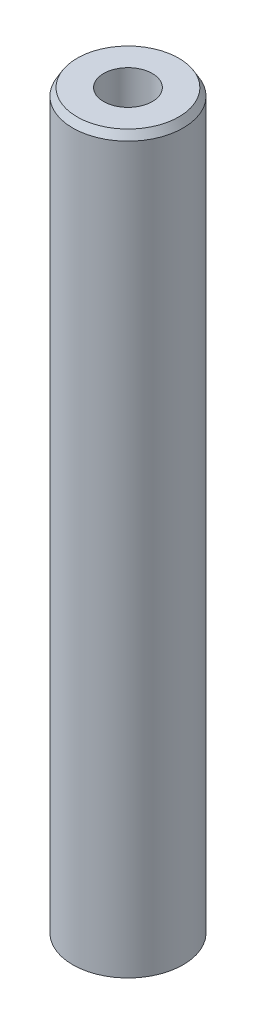
ISO-10303-21;
HEADER;
FILE_DESCRIPTION(('STEP AP214'),'2;1');
FILE_NAME('part.step','',(''),(''),'','','');
FILE_SCHEMA(('AUTOMOTIVE_DESIGN { 1 0 10303 214 1 1 1 1 }'));
ENDSEC;
DATA;
#1=APPLICATION_CONTEXT('core data for automotive mechanical design processes');
#2=APPLICATION_PROTOCOL_DEFINITION('international standard','automotive_design',2000,#1);
#3=PRODUCT_CONTEXT('',#1,'mechanical');
#4=PRODUCT('Part','Part','',(#3));
#5=PRODUCT_RELATED_PRODUCT_CATEGORY('part','',(#4));
#6=PRODUCT_DEFINITION_FORMATION('','',#4);
#7=PRODUCT_DEFINITION_CONTEXT('part definition',#1,'design');
#8=PRODUCT_DEFINITION('design','',#6,#7);
#9=PRODUCT_DEFINITION_SHAPE('','',#8);
#10=(LENGTH_UNIT() NAMED_UNIT(*) SI_UNIT(.MILLI.,.METRE.));
#11=(NAMED_UNIT(*) PLANE_ANGLE_UNIT() SI_UNIT($,.RADIAN.));
#12=(NAMED_UNIT(*) SI_UNIT($,.STERADIAN.) SOLID_ANGLE_UNIT());
#13=UNCERTAINTY_MEASURE_WITH_UNIT(LENGTH_MEASURE(1.E-05),#10,'distance_accuracy_value','');
#14=(GEOMETRIC_REPRESENTATION_CONTEXT(3) GLOBAL_UNCERTAINTY_ASSIGNED_CONTEXT((#13)) GLOBAL_UNIT_ASSIGNED_CONTEXT((#10,
#11,#12)) REPRESENTATION_CONTEXT('',''));
#15=CARTESIAN_POINT('',(0.,0.,0.));
#16=DIRECTION('',(0.,0.,1.));
#17=DIRECTION('',(1.,0.,0.));
#18=AXIS2_PLACEMENT_3D('',#15,#16,#17);
#19=CARTESIAN_POINT('',(0.,133.387566286596,0.));
#20=DIRECTION('',(0.,-1.,0.));
#21=DIRECTION('',(0.,0.,-1.));
#22=AXIS2_PLACEMENT_3D('',#19,#20,#21);
#23=CYLINDRICAL_SURFACE('',#22,10.);
#24=CARTESIAN_POINT('',(0.,132.037444312426,0.));
#25=DIRECTION('',(0.,1.,0.));
#26=DIRECTION('',(0.,0.,1.));
#27=AXIS2_PLACEMENT_3D('',#24,#25,#26);
#28=CIRCLE('',#27,10.);
#29=CARTESIAN_POINT('',(0.,132.037444312426,10.));
#30=VERTEX_POINT('',#29);
#31=EDGE_CURVE('E50',#30,#30,#28,.F.);
#32=ORIENTED_EDGE('',*,*,#31,.T.);
#33=EDGE_LOOP('',(#32));
#34=FACE_BOUND('',#33,.T.);
#35=CARTESIAN_POINT('',(0.,0.786198644598113,0.));
#36=DIRECTION('',(0.,1.,0.));
#37=DIRECTION('',(0.,0.,1.));
#38=AXIS2_PLACEMENT_3D('',#35,#36,#37);
#39=CIRCLE('',#38,10.);
#40=CARTESIAN_POINT('',(0.,0.786198644598113,10.));
#41=VERTEX_POINT('',#40);
#42=EDGE_CURVE('E51',#41,#41,#39,.T.);
#43=ORIENTED_EDGE('',*,*,#42,.T.);
#44=EDGE_LOOP('',(#43));
#45=FACE_BOUND('',#44,.T.);
#46=ADVANCED_FACE('F39',(#34,#45),#23,.T.);
#47=CARTESIAN_POINT('',(0.,133.387566286596,0.));
#48=DIRECTION('',(0.,1.,0.));
#49=DIRECTION('',(0.,0.,1.));
#50=AXIS2_PLACEMENT_3D('',#47,#48,#49);
#51=PLANE('',#50);
#52=CARTESIAN_POINT('',(0.,133.387566286596,0.));
#53=DIRECTION('',(0.,1.,0.));
#54=DIRECTION('',(0.,0.,1.));
#55=AXIS2_PLACEMENT_3D('',#52,#53,#54);
#56=CIRCLE('',#55,9.21380135540185);
#57=CARTESIAN_POINT('',(0.,133.387566286596,9.21380135540185));
#58=VERTEX_POINT('',#57);
#59=EDGE_CURVE('E54',#58,#58,#56,.T.);
#60=ORIENTED_EDGE('',*,*,#59,.T.);
#61=EDGE_LOOP('',(#60));
#62=FACE_BOUND('',#61,.T.);
#63=CARTESIAN_POINT('',(0.,133.387566286596,0.));
#64=DIRECTION('',(0.,1.,0.));
#65=DIRECTION('',(0.,0.,1.));
#66=AXIS2_PLACEMENT_3D('',#63,#64,#65);
#67=CIRCLE('',#66,4.41227959361219);
#68=CARTESIAN_POINT('',(0.,133.387566286596,4.41227959361219));
#69=VERTEX_POINT('',#68);
#70=EDGE_CURVE('E58',#69,#69,#67,.T.);
#71=ORIENTED_EDGE('',*,*,#70,.F.);
#72=EDGE_LOOP('',(#71));
#73=FACE_BOUND('',#72,.T.);
#74=ADVANCED_FACE('F69',(#62,#73),#51,.T.);
#75=CARTESIAN_POINT('',(0.,0.,0.));
#76=DIRECTION('',(0.,1.,0.));
#77=DIRECTION('',(0.,0.,1.));
#78=AXIS2_PLACEMENT_3D('',#75,#76,#77);
#79=PLANE('',#78);
#80=CARTESIAN_POINT('',(0.,0.,0.));
#81=DIRECTION('',(0.,1.,0.));
#82=DIRECTION('',(0.,0.,1.));
#83=AXIS2_PLACEMENT_3D('',#80,#81,#82);
#84=CIRCLE('',#83,8.6498780258297);
#85=CARTESIAN_POINT('',(0.,0.,8.6498780258297));
#86=VERTEX_POINT('',#85);
#87=EDGE_CURVE('E10',#86,#86,#84,.F.);
#88=ORIENTED_EDGE('',*,*,#87,.T.);
#89=EDGE_LOOP('',(#88));
#90=FACE_BOUND('',#89,.T.);
#91=CARTESIAN_POINT('',(0.,0.,0.));
#92=DIRECTION('',(0.,1.,0.));
#93=DIRECTION('',(0.,0.,1.));
#94=AXIS2_PLACEMENT_3D('',#91,#92,#93);
#95=CIRCLE('',#94,4.41227959361219);
#96=CARTESIAN_POINT('',(0.,0.,4.41227959361219));
#97=VERTEX_POINT('',#96);
#98=EDGE_CURVE('E63',#97,#97,#95,.T.);
#99=ORIENTED_EDGE('',*,*,#98,.T.);
#100=EDGE_LOOP('',(#99));
#101=FACE_BOUND('',#100,.T.);
#102=ADVANCED_FACE('F75',(#90,#101),#79,.F.);
#103=CARTESIAN_POINT('',(0.,133.387566286596,0.));
#104=DIRECTION('',(0.,-1.,0.));
#105=DIRECTION('',(0.,0.,-1.));
#106=AXIS2_PLACEMENT_3D('',#103,#104,#105);
#107=CYLINDRICAL_SURFACE('',#106,4.41227959361219);
#108=ORIENTED_EDGE('',*,*,#70,.T.);
#109=EDGE_LOOP('',(#108));
#110=FACE_BOUND('',#109,.T.);
#111=ORIENTED_EDGE('',*,*,#98,.F.);
#112=EDGE_LOOP('',(#111));
#113=FACE_BOUND('',#112,.T.);
#114=ADVANCED_FACE('F70',(#110,#113),#107,.F.);
#115=CARTESIAN_POINT('',(0.,133.387566286596,0.));
#116=DIRECTION('',(0.,-1.,0.));
#117=DIRECTION('',(0.,0.,-1.));
#118=AXIS2_PLACEMENT_3D('',#115,#116,#117);
#119=CONICAL_SURFACE('',#118,9.21380135540185,0.527315628270272);
#120=ORIENTED_EDGE('',*,*,#31,.F.);
#121=EDGE_LOOP('',(#120));
#122=FACE_BOUND('',#121,.T.);
#123=ORIENTED_EDGE('',*,*,#59,.F.);
#124=EDGE_LOOP('',(#123));
#125=FACE_BOUND('',#124,.T.);
#126=ADVANCED_FACE('F81',(#122,#125),#119,.T.);
#127=CARTESIAN_POINT('',(0.,0.786198644598113,0.));
#128=DIRECTION('',(0.,1.,0.));
#129=DIRECTION('',(0.,0.,1.));
#130=AXIS2_PLACEMENT_3D('',#127,#128,#129);
#131=CONICAL_SURFACE('',#130,10.,1.04348069852462);
#132=ORIENTED_EDGE('',*,*,#87,.F.);
#133=EDGE_LOOP('',(#132));
#134=FACE_BOUND('',#133,.T.);
#135=ORIENTED_EDGE('',*,*,#42,.F.);
#136=EDGE_LOOP('',(#135));
#137=FACE_BOUND('',#136,.T.);
#138=ADVANCED_FACE('F45',(#134,#137),#131,.T.);
#139=CLOSED_SHELL('',(#46,#74,#102,#114,#126,#138));
#140=MANIFOLD_SOLID_BREP('B2',#139);
#141=ADVANCED_BREP_SHAPE_REPRESENTATION('',(#18,#140),#14);
#142=SHAPE_DEFINITION_REPRESENTATION(#9,#141);
ENDSEC;
END-ISO-10303-21;
